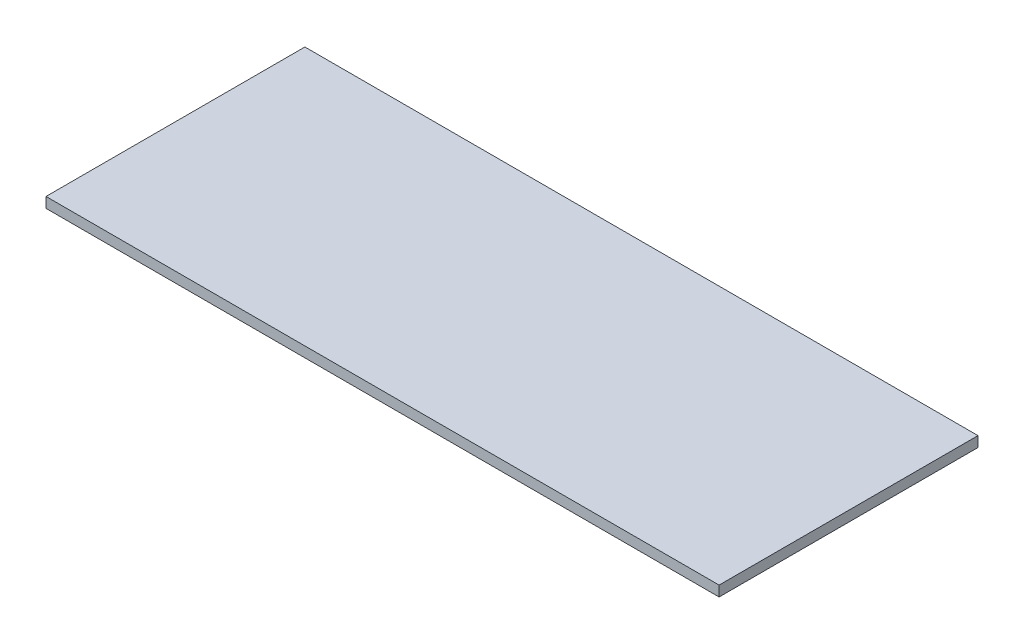
ISO-10303-21;
HEADER;
FILE_DESCRIPTION(('STEP AP214'),'2;1');
FILE_NAME('part.step','',(''),(''),'','','');
FILE_SCHEMA(('AUTOMOTIVE_DESIGN { 1 0 10303 214 1 1 1 1 }'));
ENDSEC;
DATA;
#1=APPLICATION_CONTEXT('core data for automotive mechanical design processes');
#2=APPLICATION_PROTOCOL_DEFINITION('international standard','automotive_design',2000,#1);
#3=PRODUCT_CONTEXT('',#1,'mechanical');
#4=PRODUCT('Part','Part','',(#3));
#5=PRODUCT_RELATED_PRODUCT_CATEGORY('part','',(#4));
#6=PRODUCT_DEFINITION_FORMATION('','',#4);
#7=PRODUCT_DEFINITION_CONTEXT('part definition',#1,'design');
#8=PRODUCT_DEFINITION('design','',#6,#7);
#9=PRODUCT_DEFINITION_SHAPE('','',#8);
#10=(LENGTH_UNIT() NAMED_UNIT(*) SI_UNIT(.MILLI.,.METRE.));
#11=(NAMED_UNIT(*) PLANE_ANGLE_UNIT() SI_UNIT($,.RADIAN.));
#12=(NAMED_UNIT(*) SI_UNIT($,.STERADIAN.) SOLID_ANGLE_UNIT());
#13=UNCERTAINTY_MEASURE_WITH_UNIT(LENGTH_MEASURE(1.E-05),#10,'distance_accuracy_value','');
#14=(GEOMETRIC_REPRESENTATION_CONTEXT(3) GLOBAL_UNCERTAINTY_ASSIGNED_CONTEXT((#13)) GLOBAL_UNIT_ASSIGNED_CONTEXT((#10,
#11,#12)) REPRESENTATION_CONTEXT('',''));
#15=CARTESIAN_POINT('',(0.,0.,0.));
#16=DIRECTION('',(0.,0.,1.));
#17=DIRECTION('',(1.,0.,0.));
#18=AXIS2_PLACEMENT_3D('',#15,#16,#17);
#19=CARTESIAN_POINT('',(260.,8.,-100.));
#20=DIRECTION('',(-1.,0.,0.));
#21=DIRECTION('',(0.,0.,1.));
#22=AXIS2_PLACEMENT_3D('',#19,#20,#21);
#23=PLANE('',#22);
#24=DIRECTION('',(0.,0.,-1.));
#25=VECTOR('',#24,1.);
#26=CARTESIAN_POINT('',(260.,0.,-100.));
#27=LINE('',#26,#25);
#28=CARTESIAN_POINT('',(260.,0.,100.));
#29=VERTEX_POINT('',#28);
#30=CARTESIAN_POINT('',(260.,0.,-100.));
#31=VERTEX_POINT('',#30);
#32=EDGE_CURVE('E102',#29,#31,#27,.T.);
#33=ORIENTED_EDGE('',*,*,#32,.T.);
#34=DIRECTION('',(0.,-1.,0.));
#35=VECTOR('',#34,1.);
#36=CARTESIAN_POINT('',(260.,8.,-100.));
#37=LINE('',#36,#35);
#38=CARTESIAN_POINT('',(260.,8.,-100.));
#39=VERTEX_POINT('',#38);
#40=EDGE_CURVE('E11',#39,#31,#37,.T.);
#41=ORIENTED_EDGE('',*,*,#40,.F.);
#42=DIRECTION('',(0.,0.,-1.));
#43=VECTOR('',#42,1.);
#44=CARTESIAN_POINT('',(260.,8.,-100.));
#45=LINE('',#44,#43);
#46=CARTESIAN_POINT('',(260.,8.,100.));
#47=VERTEX_POINT('',#46);
#48=EDGE_CURVE('E90',#47,#39,#45,.T.);
#49=ORIENTED_EDGE('',*,*,#48,.F.);
#50=DIRECTION('',(0.,-1.,0.));
#51=VECTOR('',#50,1.);
#52=CARTESIAN_POINT('',(260.,8.,100.));
#53=LINE('',#52,#51);
#54=EDGE_CURVE('E98',#47,#29,#53,.T.);
#55=ORIENTED_EDGE('',*,*,#54,.T.);
#56=EDGE_LOOP('',(#33,#41,#49,#55));
#57=FACE_BOUND('',#56,.T.);
#58=ADVANCED_FACE('F39',(#57),#23,.F.);
#59=CARTESIAN_POINT('',(-260.,8.,-100.));
#60=DIRECTION('',(0.,0.,1.));
#61=DIRECTION('',(1.,0.,0.));
#62=AXIS2_PLACEMENT_3D('',#59,#60,#61);
#63=PLANE('',#62);
#64=DIRECTION('',(-1.,0.,0.));
#65=VECTOR('',#64,1.);
#66=CARTESIAN_POINT('',(-260.,0.,-100.));
#67=LINE('',#66,#65);
#68=CARTESIAN_POINT('',(-260.,0.,-100.));
#69=VERTEX_POINT('',#68);
#70=EDGE_CURVE('E94',#31,#69,#67,.T.);
#71=ORIENTED_EDGE('',*,*,#70,.T.);
#72=DIRECTION('',(0.,-1.,0.));
#73=VECTOR('',#72,1.);
#74=CARTESIAN_POINT('',(-260.,8.,-100.));
#75=LINE('',#74,#73);
#76=CARTESIAN_POINT('',(-260.,8.,-100.));
#77=VERTEX_POINT('',#76);
#78=EDGE_CURVE('E47',#77,#69,#75,.T.);
#79=ORIENTED_EDGE('',*,*,#78,.F.);
#80=DIRECTION('',(-1.,0.,0.));
#81=VECTOR('',#80,1.);
#82=CARTESIAN_POINT('',(-260.,8.,-100.));
#83=LINE('',#82,#81);
#84=EDGE_CURVE('E85',#39,#77,#83,.T.);
#85=ORIENTED_EDGE('',*,*,#84,.F.);
#86=ORIENTED_EDGE('',*,*,#40,.T.);
#87=EDGE_LOOP('',(#71,#79,#85,#86));
#88=FACE_BOUND('',#87,.T.);
#89=ADVANCED_FACE('F93',(#88),#63,.F.);
#90=CARTESIAN_POINT('',(-260.,8.,-100.));
#91=DIRECTION('',(1.,0.,0.));
#92=DIRECTION('',(0.,0.,-1.));
#93=AXIS2_PLACEMENT_3D('',#90,#91,#92);
#94=PLANE('',#93);
#95=DIRECTION('',(0.,0.,1.));
#96=VECTOR('',#95,1.);
#97=CARTESIAN_POINT('',(-260.,0.,-100.));
#98=LINE('',#97,#96);
#99=CARTESIAN_POINT('',(-260.,0.,100.));
#100=VERTEX_POINT('',#99);
#101=EDGE_CURVE('E72',#69,#100,#98,.T.);
#102=ORIENTED_EDGE('',*,*,#101,.T.);
#103=DIRECTION('',(0.,-1.,0.));
#104=VECTOR('',#103,1.);
#105=CARTESIAN_POINT('',(-260.,8.,100.));
#106=LINE('',#105,#104);
#107=CARTESIAN_POINT('',(-260.,8.,100.));
#108=VERTEX_POINT('',#107);
#109=EDGE_CURVE('E95',#108,#100,#106,.T.);
#110=ORIENTED_EDGE('',*,*,#109,.F.);
#111=DIRECTION('',(0.,0.,1.));
#112=VECTOR('',#111,1.);
#113=CARTESIAN_POINT('',(-260.,8.,-100.));
#114=LINE('',#113,#112);
#115=EDGE_CURVE('E88',#77,#108,#114,.T.);
#116=ORIENTED_EDGE('',*,*,#115,.F.);
#117=ORIENTED_EDGE('',*,*,#78,.T.);
#118=EDGE_LOOP('',(#102,#110,#116,#117));
#119=FACE_BOUND('',#118,.T.);
#120=ADVANCED_FACE('F96',(#119),#94,.F.);
#121=CARTESIAN_POINT('',(-260.,8.,100.));
#122=DIRECTION('',(0.,0.,-1.));
#123=DIRECTION('',(-1.,0.,0.));
#124=AXIS2_PLACEMENT_3D('',#121,#122,#123);
#125=PLANE('',#124);
#126=DIRECTION('',(1.,0.,0.));
#127=VECTOR('',#126,1.);
#128=CARTESIAN_POINT('',(-260.,0.,100.));
#129=LINE('',#128,#127);
#130=EDGE_CURVE('E78',#100,#29,#129,.T.);
#131=ORIENTED_EDGE('',*,*,#130,.T.);
#132=ORIENTED_EDGE('',*,*,#54,.F.);
#133=DIRECTION('',(1.,0.,0.));
#134=VECTOR('',#133,1.);
#135=CARTESIAN_POINT('',(-260.,8.,100.));
#136=LINE('',#135,#134);
#137=EDGE_CURVE('E55',#108,#47,#136,.T.);
#138=ORIENTED_EDGE('',*,*,#137,.F.);
#139=ORIENTED_EDGE('',*,*,#109,.T.);
#140=EDGE_LOOP('',(#131,#132,#138,#139));
#141=FACE_BOUND('',#140,.T.);
#142=ADVANCED_FACE('F109',(#141),#125,.F.);
#143=CARTESIAN_POINT('',(0.,8.,0.));
#144=DIRECTION('',(0.,1.,0.));
#145=DIRECTION('',(0.,0.,1.));
#146=AXIS2_PLACEMENT_3D('',#143,#144,#145);
#147=PLANE('',#146);
#148=ORIENTED_EDGE('',*,*,#48,.T.);
#149=ORIENTED_EDGE('',*,*,#84,.T.);
#150=ORIENTED_EDGE('',*,*,#115,.T.);
#151=ORIENTED_EDGE('',*,*,#137,.T.);
#152=EDGE_LOOP('',(#148,#149,#150,#151));
#153=FACE_BOUND('',#152,.T.);
#154=ADVANCED_FACE('F86',(#153),#147,.T.);
#155=CARTESIAN_POINT('',(0.,0.,0.));
#156=DIRECTION('',(0.,1.,0.));
#157=DIRECTION('',(0.,0.,1.));
#158=AXIS2_PLACEMENT_3D('',#155,#156,#157);
#159=PLANE('',#158);
#160=ORIENTED_EDGE('',*,*,#32,.F.);
#161=ORIENTED_EDGE('',*,*,#130,.F.);
#162=ORIENTED_EDGE('',*,*,#101,.F.);
#163=ORIENTED_EDGE('',*,*,#70,.F.);
#164=EDGE_LOOP('',(#160,#161,#162,#163));
#165=FACE_BOUND('',#164,.T.);
#166=ADVANCED_FACE('F112',(#165),#159,.F.);
#167=CLOSED_SHELL('',(#58,#89,#120,#142,#154,#166));
#168=MANIFOLD_SOLID_BREP('B2',#167);
#169=ADVANCED_BREP_SHAPE_REPRESENTATION('',(#18,#168),#14);
#170=SHAPE_DEFINITION_REPRESENTATION(#9,#169);
ENDSEC;
END-ISO-10303-21;
